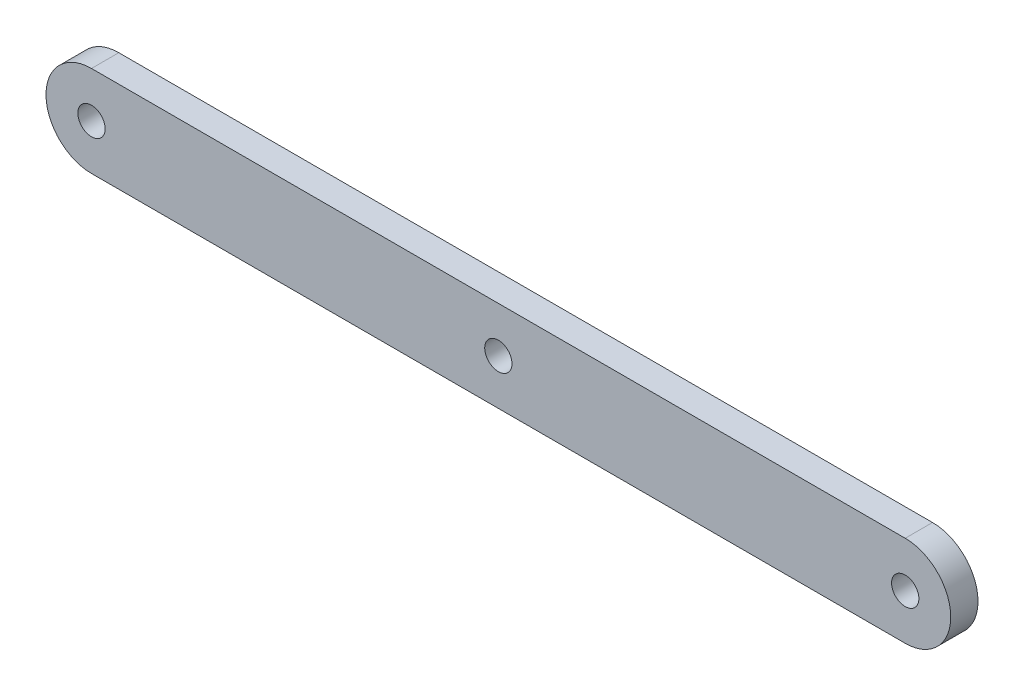
ISO-10303-21;
HEADER;
FILE_DESCRIPTION(('STEP AP214'),'2;1');
FILE_NAME('part.step','',(''),(''),'','','');
FILE_SCHEMA(('AUTOMOTIVE_DESIGN { 1 0 10303 214 1 1 1 1 }'));
ENDSEC;
DATA;
#1=APPLICATION_CONTEXT('core data for automotive mechanical design processes');
#2=APPLICATION_PROTOCOL_DEFINITION('international standard','automotive_design',2000,#1);
#3=PRODUCT_CONTEXT('',#1,'mechanical');
#4=PRODUCT('Part','Part','',(#3));
#5=PRODUCT_RELATED_PRODUCT_CATEGORY('part','',(#4));
#6=PRODUCT_DEFINITION_FORMATION('','',#4);
#7=PRODUCT_DEFINITION_CONTEXT('part definition',#1,'design');
#8=PRODUCT_DEFINITION('design','',#6,#7);
#9=PRODUCT_DEFINITION_SHAPE('','',#8);
#10=(LENGTH_UNIT() NAMED_UNIT(*) SI_UNIT(.MILLI.,.METRE.));
#11=(NAMED_UNIT(*) PLANE_ANGLE_UNIT() SI_UNIT($,.RADIAN.));
#12=(NAMED_UNIT(*) SI_UNIT($,.STERADIAN.) SOLID_ANGLE_UNIT());
#13=UNCERTAINTY_MEASURE_WITH_UNIT(LENGTH_MEASURE(1.E-05),#10,'distance_accuracy_value','');
#14=(GEOMETRIC_REPRESENTATION_CONTEXT(3) GLOBAL_UNCERTAINTY_ASSIGNED_CONTEXT((#13)) GLOBAL_UNIT_ASSIGNED_CONTEXT((#10,
#11,#12)) REPRESENTATION_CONTEXT('',''));
#15=CARTESIAN_POINT('',(0.,0.,0.));
#16=DIRECTION('',(0.,0.,1.));
#17=DIRECTION('',(1.,0.,0.));
#18=AXIS2_PLACEMENT_3D('',#15,#16,#17);
#19=CARTESIAN_POINT('',(-22.36,0.,0.75));
#20=DIRECTION('',(0.,0.,1.));
#21=DIRECTION('',(1.,0.,0.));
#22=AXIS2_PLACEMENT_3D('',#19,#20,#21);
#23=PLANE('',#22);
#24=CARTESIAN_POINT('',(-22.3599999999962,-4.85722573273506E-13,0.75));
#25=DIRECTION('',(0.,0.,1.));
#26=DIRECTION('',(1.,0.,0.));
#27=AXIS2_PLACEMENT_3D('',#24,#25,#26);
#28=CIRCLE('',#27,0.750000000000002);
#29=CARTESIAN_POINT('',(-21.6099999999962,-4.85722573273506E-13,0.75));
#30=VERTEX_POINT('',#29);
#31=EDGE_CURVE('E115',#30,#30,#28,.T.);
#32=ORIENTED_EDGE('',*,*,#31,.F.);
#33=EDGE_LOOP('',(#32));
#34=FACE_BOUND('',#33,.T.);
#35=CARTESIAN_POINT('',(-22.36,0.,0.75));
#36=DIRECTION('',(0.,0.,1.));
#37=DIRECTION('',(1.,0.,0.));
#38=AXIS2_PLACEMENT_3D('',#35,#36,#37);
#39=CIRCLE('',#38,2.50000000000001);
#40=CARTESIAN_POINT('',(-22.36,2.50000000000001,0.75));
#41=VERTEX_POINT('',#40);
#42=CARTESIAN_POINT('',(-22.36,-2.50000000000001,0.75));
#43=VERTEX_POINT('',#42);
#44=EDGE_CURVE('E85',#41,#43,#39,.T.);
#45=ORIENTED_EDGE('',*,*,#44,.T.);
#46=DIRECTION('',(1.,0.,0.));
#47=VECTOR('',#46,1.);
#48=CARTESIAN_POINT('',(-22.36,-2.50000000000001,0.75));
#49=LINE('',#48,#47);
#50=CARTESIAN_POINT('',(22.36,-2.5,0.75));
#51=VERTEX_POINT('',#50);
#52=EDGE_CURVE('E80',#43,#51,#49,.T.);
#53=ORIENTED_EDGE('',*,*,#52,.T.);
#54=CARTESIAN_POINT('',(22.36,0.,0.75));
#55=DIRECTION('',(0.,0.,1.));
#56=DIRECTION('',(1.,0.,0.));
#57=AXIS2_PLACEMENT_3D('',#54,#55,#56);
#58=CIRCLE('',#57,2.50000000000001);
#59=CARTESIAN_POINT('',(22.36,2.50000000000002,0.75));
#60=VERTEX_POINT('',#59);
#61=EDGE_CURVE('E83',#51,#60,#58,.T.);
#62=ORIENTED_EDGE('',*,*,#61,.T.);
#63=DIRECTION('',(-1.,0.,0.));
#64=VECTOR('',#63,1.);
#65=CARTESIAN_POINT('',(-22.36,2.50000000000001,0.75));
#66=LINE('',#65,#64);
#67=EDGE_CURVE('E50',#60,#41,#66,.T.);
#68=ORIENTED_EDGE('',*,*,#67,.T.);
#69=EDGE_LOOP('',(#45,#53,#62,#68));
#70=FACE_BOUND('',#69,.T.);
#71=CARTESIAN_POINT('',(22.36,0.,0.75));
#72=DIRECTION('',(0.,0.,1.));
#73=DIRECTION('',(1.,0.,0.));
#74=AXIS2_PLACEMENT_3D('',#71,#72,#73);
#75=CIRCLE('',#74,0.750000000000002);
#76=CARTESIAN_POINT('',(23.11,0.,0.75));
#77=VERTEX_POINT('',#76);
#78=EDGE_CURVE('E100',#77,#77,#75,.T.);
#79=ORIENTED_EDGE('',*,*,#78,.F.);
#80=EDGE_LOOP('',(#79));
#81=FACE_BOUND('',#80,.T.);
#82=CARTESIAN_POINT('',(0.,0.,0.75));
#83=DIRECTION('',(0.,0.,1.));
#84=DIRECTION('',(1.,0.,0.));
#85=AXIS2_PLACEMENT_3D('',#82,#83,#84);
#86=CIRCLE('',#85,0.75);
#87=CARTESIAN_POINT('',(0.749999999999993,0.,0.75));
#88=VERTEX_POINT('',#87);
#89=EDGE_CURVE('E121',#88,#88,#86,.T.);
#90=ORIENTED_EDGE('',*,*,#89,.F.);
#91=EDGE_LOOP('',(#90));
#92=FACE_BOUND('',#91,.T.);
#93=ADVANCED_FACE('F33',(#34,#70,#81,#92),#23,.T.);
#94=CARTESIAN_POINT('',(-22.36,0.,-0.75));
#95=DIRECTION('',(0.,0.,1.));
#96=DIRECTION('',(1.,0.,0.));
#97=AXIS2_PLACEMENT_3D('',#94,#95,#96);
#98=PLANE('',#97);
#99=CARTESIAN_POINT('',(-22.36,0.,-0.75));
#100=DIRECTION('',(0.,0.,1.));
#101=DIRECTION('',(1.,0.,0.));
#102=AXIS2_PLACEMENT_3D('',#99,#100,#101);
#103=CIRCLE('',#102,2.50000000000001);
#104=CARTESIAN_POINT('',(-22.36,2.50000000000001,-0.75));
#105=VERTEX_POINT('',#104);
#106=CARTESIAN_POINT('',(-22.36,-2.50000000000001,-0.75));
#107=VERTEX_POINT('',#106);
#108=EDGE_CURVE('E97',#105,#107,#103,.T.);
#109=ORIENTED_EDGE('',*,*,#108,.F.);
#110=DIRECTION('',(-1.,0.,0.));
#111=VECTOR('',#110,1.);
#112=CARTESIAN_POINT('',(-22.36,2.50000000000001,-0.75));
#113=LINE('',#112,#111);
#114=CARTESIAN_POINT('',(22.36,2.50000000000002,-0.75));
#115=VERTEX_POINT('',#114);
#116=EDGE_CURVE('E73',#115,#105,#113,.T.);
#117=ORIENTED_EDGE('',*,*,#116,.F.);
#118=CARTESIAN_POINT('',(22.36,0.,-0.75));
#119=DIRECTION('',(0.,0.,1.));
#120=DIRECTION('',(1.,0.,0.));
#121=AXIS2_PLACEMENT_3D('',#118,#119,#120);
#122=CIRCLE('',#121,2.50000000000001);
#123=CARTESIAN_POINT('',(22.36,-2.5,-0.75));
#124=VERTEX_POINT('',#123);
#125=EDGE_CURVE('E67',#124,#115,#122,.T.);
#126=ORIENTED_EDGE('',*,*,#125,.F.);
#127=DIRECTION('',(1.,0.,0.));
#128=VECTOR('',#127,1.);
#129=CARTESIAN_POINT('',(-22.36,-2.50000000000001,-0.75));
#130=LINE('',#129,#128);
#131=EDGE_CURVE('E89',#107,#124,#130,.T.);
#132=ORIENTED_EDGE('',*,*,#131,.F.);
#133=EDGE_LOOP('',(#109,#117,#126,#132));
#134=FACE_BOUND('',#133,.T.);
#135=CARTESIAN_POINT('',(22.36,0.,-0.75));
#136=DIRECTION('',(0.,0.,1.));
#137=DIRECTION('',(1.,0.,0.));
#138=AXIS2_PLACEMENT_3D('',#135,#136,#137);
#139=CIRCLE('',#138,0.750000000000002);
#140=CARTESIAN_POINT('',(23.11,0.,-0.75));
#141=VERTEX_POINT('',#140);
#142=EDGE_CURVE('E112',#141,#141,#139,.T.);
#143=ORIENTED_EDGE('',*,*,#142,.T.);
#144=EDGE_LOOP('',(#143));
#145=FACE_BOUND('',#144,.T.);
#146=CARTESIAN_POINT('',(-22.3599999999962,-4.85722573273506E-13,-0.75));
#147=DIRECTION('',(0.,0.,1.));
#148=DIRECTION('',(1.,0.,0.));
#149=AXIS2_PLACEMENT_3D('',#146,#147,#148);
#150=CIRCLE('',#149,0.750000000000002);
#151=CARTESIAN_POINT('',(-21.6099999999962,-4.85722573273506E-13,-0.75));
#152=VERTEX_POINT('',#151);
#153=EDGE_CURVE('E118',#152,#152,#150,.T.);
#154=ORIENTED_EDGE('',*,*,#153,.T.);
#155=EDGE_LOOP('',(#154));
#156=FACE_BOUND('',#155,.T.);
#157=CARTESIAN_POINT('',(0.,0.,-0.75));
#158=DIRECTION('',(0.,0.,1.));
#159=DIRECTION('',(1.,0.,0.));
#160=AXIS2_PLACEMENT_3D('',#157,#158,#159);
#161=CIRCLE('',#160,0.75);
#162=CARTESIAN_POINT('',(0.749999999999993,0.,-0.75));
#163=VERTEX_POINT('',#162);
#164=EDGE_CURVE('E124',#163,#163,#161,.T.);
#165=ORIENTED_EDGE('',*,*,#164,.T.);
#166=EDGE_LOOP('',(#165));
#167=FACE_BOUND('',#166,.T.);
#168=ADVANCED_FACE('F108',(#134,#145,#156,#167),#98,.F.);
#169=CARTESIAN_POINT('',(-22.36,0.,0.75));
#170=DIRECTION('',(0.,0.,-1.));
#171=DIRECTION('',(-1.,0.,0.));
#172=AXIS2_PLACEMENT_3D('',#169,#170,#171);
#173=CYLINDRICAL_SURFACE('',#172,2.50000000000001);
#174=ORIENTED_EDGE('',*,*,#108,.T.);
#175=DIRECTION('',(0.,0.,-1.));
#176=VECTOR('',#175,1.);
#177=CARTESIAN_POINT('',(-22.36,-2.50000000000001,0.75));
#178=LINE('',#177,#176);
#179=EDGE_CURVE('E11',#43,#107,#178,.T.);
#180=ORIENTED_EDGE('',*,*,#179,.F.);
#181=ORIENTED_EDGE('',*,*,#44,.F.);
#182=DIRECTION('',(0.,0.,-1.));
#183=VECTOR('',#182,1.);
#184=CARTESIAN_POINT('',(-22.36,2.50000000000001,0.75));
#185=LINE('',#184,#183);
#186=EDGE_CURVE('E93',#41,#105,#185,.T.);
#187=ORIENTED_EDGE('',*,*,#186,.T.);
#188=EDGE_LOOP('',(#174,#180,#181,#187));
#189=FACE_BOUND('',#188,.T.);
#190=ADVANCED_FACE('F35',(#189),#173,.T.);
#191=CARTESIAN_POINT('',(-22.36,-2.50000000000001,0.75));
#192=DIRECTION('',(0.,1.,0.));
#193=DIRECTION('',(-1.,0.,0.));
#194=AXIS2_PLACEMENT_3D('',#191,#192,#193);
#195=PLANE('',#194);
#196=ORIENTED_EDGE('',*,*,#131,.T.);
#197=DIRECTION('',(0.,0.,-1.));
#198=VECTOR('',#197,1.);
#199=CARTESIAN_POINT('',(22.36,-2.5,0.75));
#200=LINE('',#199,#198);
#201=EDGE_CURVE('E42',#51,#124,#200,.T.);
#202=ORIENTED_EDGE('',*,*,#201,.F.);
#203=ORIENTED_EDGE('',*,*,#52,.F.);
#204=ORIENTED_EDGE('',*,*,#179,.T.);
#205=EDGE_LOOP('',(#196,#202,#203,#204));
#206=FACE_BOUND('',#205,.T.);
#207=ADVANCED_FACE('F88',(#206),#195,.F.);
#208=CARTESIAN_POINT('',(22.36,0.,0.75));
#209=DIRECTION('',(0.,0.,-1.));
#210=DIRECTION('',(-1.,0.,0.));
#211=AXIS2_PLACEMENT_3D('',#208,#209,#210);
#212=CYLINDRICAL_SURFACE('',#211,2.50000000000001);
#213=ORIENTED_EDGE('',*,*,#125,.T.);
#214=DIRECTION('',(0.,0.,-1.));
#215=VECTOR('',#214,1.);
#216=CARTESIAN_POINT('',(22.36,2.50000000000002,0.75));
#217=LINE('',#216,#215);
#218=EDGE_CURVE('E90',#60,#115,#217,.T.);
#219=ORIENTED_EDGE('',*,*,#218,.F.);
#220=ORIENTED_EDGE('',*,*,#61,.F.);
#221=ORIENTED_EDGE('',*,*,#201,.T.);
#222=EDGE_LOOP('',(#213,#219,#220,#221));
#223=FACE_BOUND('',#222,.T.);
#224=ADVANCED_FACE('F91',(#223),#212,.T.);
#225=CARTESIAN_POINT('',(-22.36,2.50000000000001,0.75));
#226=DIRECTION('',(0.,-1.,0.));
#227=DIRECTION('',(1.,0.,0.));
#228=AXIS2_PLACEMENT_3D('',#225,#226,#227);
#229=PLANE('',#228);
#230=ORIENTED_EDGE('',*,*,#116,.T.);
#231=ORIENTED_EDGE('',*,*,#186,.F.);
#232=ORIENTED_EDGE('',*,*,#67,.F.);
#233=ORIENTED_EDGE('',*,*,#218,.T.);
#234=EDGE_LOOP('',(#230,#231,#232,#233));
#235=FACE_BOUND('',#234,.T.);
#236=ADVANCED_FACE('F105',(#235),#229,.F.);
#237=CARTESIAN_POINT('',(22.36,0.,0.75));
#238=DIRECTION('',(0.,0.,-1.));
#239=DIRECTION('',(-1.,0.,0.));
#240=AXIS2_PLACEMENT_3D('',#237,#238,#239);
#241=CYLINDRICAL_SURFACE('',#240,0.750000000000002);
#242=ORIENTED_EDGE('',*,*,#78,.T.);
#243=EDGE_LOOP('',(#242));
#244=FACE_BOUND('',#243,.T.);
#245=ORIENTED_EDGE('',*,*,#142,.F.);
#246=EDGE_LOOP('',(#245));
#247=FACE_BOUND('',#246,.T.);
#248=ADVANCED_FACE('F142',(#244,#247),#241,.F.);
#249=CARTESIAN_POINT('',(-22.3599999999962,-4.85722573273506E-13,0.75));
#250=DIRECTION('',(0.,0.,-1.));
#251=DIRECTION('',(-1.,0.,0.));
#252=AXIS2_PLACEMENT_3D('',#249,#250,#251);
#253=CYLINDRICAL_SURFACE('',#252,0.750000000000002);
#254=ORIENTED_EDGE('',*,*,#31,.T.);
#255=EDGE_LOOP('',(#254));
#256=FACE_BOUND('',#255,.T.);
#257=ORIENTED_EDGE('',*,*,#153,.F.);
#258=EDGE_LOOP('',(#257));
#259=FACE_BOUND('',#258,.T.);
#260=ADVANCED_FACE('F188',(#256,#259),#253,.F.);
#261=CARTESIAN_POINT('',(0.,0.,0.75));
#262=DIRECTION('',(0.,0.,-1.));
#263=DIRECTION('',(-1.,0.,0.));
#264=AXIS2_PLACEMENT_3D('',#261,#262,#263);
#265=CYLINDRICAL_SURFACE('',#264,0.75);
#266=ORIENTED_EDGE('',*,*,#89,.T.);
#267=EDGE_LOOP('',(#266));
#268=FACE_BOUND('',#267,.T.);
#269=ORIENTED_EDGE('',*,*,#164,.F.);
#270=EDGE_LOOP('',(#269));
#271=FACE_BOUND('',#270,.T.);
#272=ADVANCED_FACE('F130',(#268,#271),#265,.F.);
#273=CLOSED_SHELL('',(#93,#168,#190,#207,#224,#236,#248,#260,#272));
#274=MANIFOLD_SOLID_BREP('B2',#273);
#275=ADVANCED_BREP_SHAPE_REPRESENTATION('',(#18,#274),#14);
#276=SHAPE_DEFINITION_REPRESENTATION(#9,#275);
ENDSEC;
END-ISO-10303-21;
